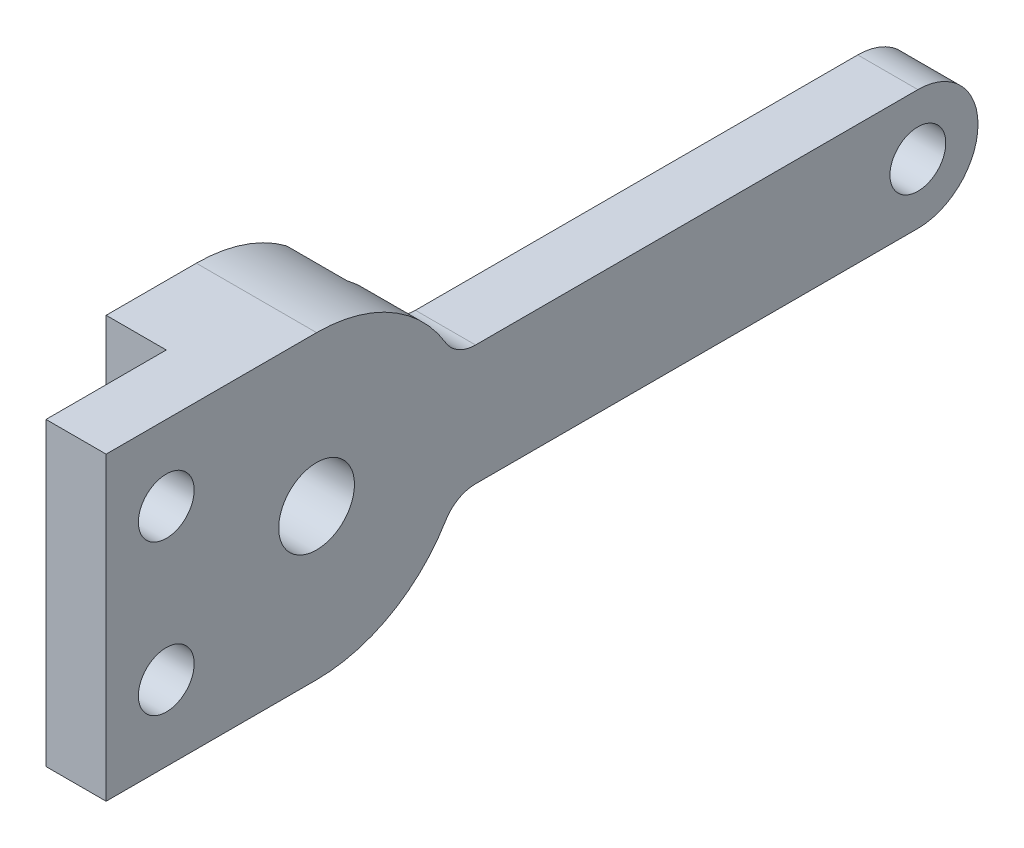
ISO-10303-21;
HEADER;
FILE_DESCRIPTION(('STEP AP214'),'2;1');
FILE_NAME('part.step','',(''),(''),'','','');
FILE_SCHEMA(('AUTOMOTIVE_DESIGN { 1 0 10303 214 1 1 1 1 }'));
ENDSEC;
DATA;
#1=APPLICATION_CONTEXT('core data for automotive mechanical design processes');
#2=APPLICATION_PROTOCOL_DEFINITION('international standard','automotive_design',2000,#1);
#3=PRODUCT_CONTEXT('',#1,'mechanical');
#4=PRODUCT('Part','Part','',(#3));
#5=PRODUCT_RELATED_PRODUCT_CATEGORY('part','',(#4));
#6=PRODUCT_DEFINITION_FORMATION('','',#4);
#7=PRODUCT_DEFINITION_CONTEXT('part definition',#1,'design');
#8=PRODUCT_DEFINITION('design','',#6,#7);
#9=PRODUCT_DEFINITION_SHAPE('','',#8);
#10=(LENGTH_UNIT() NAMED_UNIT(*) SI_UNIT(.MILLI.,.METRE.));
#11=(NAMED_UNIT(*) PLANE_ANGLE_UNIT() SI_UNIT($,.RADIAN.));
#12=(NAMED_UNIT(*) SI_UNIT($,.STERADIAN.) SOLID_ANGLE_UNIT());
#13=UNCERTAINTY_MEASURE_WITH_UNIT(LENGTH_MEASURE(1.E-05),#10,'distance_accuracy_value','');
#14=(GEOMETRIC_REPRESENTATION_CONTEXT(3) GLOBAL_UNCERTAINTY_ASSIGNED_CONTEXT((#13)) GLOBAL_UNIT_ASSIGNED_CONTEXT((#10,
#11,#12)) REPRESENTATION_CONTEXT('',''));
#15=CARTESIAN_POINT('',(0.,0.,0.));
#16=DIRECTION('',(0.,0.,1.));
#17=DIRECTION('',(1.,0.,0.));
#18=AXIS2_PLACEMENT_3D('',#15,#16,#17);
#19=CARTESIAN_POINT('',(6.35,0.,0.));
#20=DIRECTION('',(-1.,0.,0.));
#21=DIRECTION('',(0.,0.,1.));
#22=AXIS2_PLACEMENT_3D('',#19,#20,#21);
#23=PLANE('',#22);
#24=CARTESIAN_POINT('',(6.35,0.,-31.75));
#25=DIRECTION('',(-1.,0.,0.));
#26=DIRECTION('',(0.,0.,1.));
#27=AXIS2_PLACEMENT_3D('',#24,#25,#26);
#28=CIRCLE('',#27,1.4732);
#29=CARTESIAN_POINT('',(6.35,0.,-30.2768));
#30=VERTEX_POINT('',#29);
#31=EDGE_CURVE('E280',#30,#30,#28,.T.);
#32=ORIENTED_EDGE('',*,*,#31,.T.);
#33=EDGE_LOOP('',(#32));
#34=FACE_BOUND('',#33,.T.);
#35=CARTESIAN_POINT('',(6.35,3.96875,7.9375));
#36=DIRECTION('',(1.,0.,0.));
#37=DIRECTION('',(0.,0.,-1.));
#38=AXIS2_PLACEMENT_3D('',#35,#36,#37);
#39=CIRCLE('',#38,1.4732);
#40=CARTESIAN_POINT('',(6.35,3.96875,6.4643));
#41=VERTEX_POINT('',#40);
#42=EDGE_CURVE('E277',#41,#41,#39,.T.);
#43=ORIENTED_EDGE('',*,*,#42,.F.);
#44=EDGE_LOOP('',(#43));
#45=FACE_BOUND('',#44,.T.);
#46=DIRECTION('',(0.,-1.,0.));
#47=VECTOR('',#46,1.);
#48=CARTESIAN_POINT('',(6.35,7.9375,11.1125));
#49=LINE('',#48,#47);
#50=CARTESIAN_POINT('',(6.35,7.9375,11.1125));
#51=VERTEX_POINT('',#50);
#52=CARTESIAN_POINT('',(6.35,-7.9375,11.1125));
#53=VERTEX_POINT('',#52);
#54=EDGE_CURVE('E173',#51,#53,#49,.T.);
#55=ORIENTED_EDGE('',*,*,#54,.T.);
#56=DIRECTION('',(0.,0.,-1.));
#57=VECTOR('',#56,1.);
#58=CARTESIAN_POINT('',(6.35,-7.9375,11.1125));
#59=LINE('',#58,#57);
#60=CARTESIAN_POINT('',(6.35,-7.9375,0.));
#61=VERTEX_POINT('',#60);
#62=EDGE_CURVE('E239',#53,#61,#59,.T.);
#63=ORIENTED_EDGE('',*,*,#62,.T.);
#64=CARTESIAN_POINT('',(6.35,0.,0.));
#65=DIRECTION('',(1.,0.,0.));
#66=DIRECTION('',(0.,0.,1.));
#67=AXIS2_PLACEMENT_3D('',#64,#65,#66);
#68=CIRCLE('',#67,7.9375);
#69=CARTESIAN_POINT('',(6.35,-4.07183441558442,-6.81352117058884));
#70=VERTEX_POINT('',#69);
#71=EDGE_CURVE('E236',#61,#70,#68,.T.);
#72=ORIENTED_EDGE('',*,*,#71,.T.);
#73=CARTESIAN_POINT('',(6.35,-5.0165,-8.39425808216545));
#74=DIRECTION('',(-1.,0.,0.));
#75=DIRECTION('',(0.,0.,1.));
#76=AXIS2_PLACEMENT_3D('',#73,#74,#75);
#77=CIRCLE('',#76,1.8415);
#78=CARTESIAN_POINT('',(6.35,-3.175,-8.39425808216545));
#79=VERTEX_POINT('',#78);
#80=EDGE_CURVE('E201',#70,#79,#77,.T.);
#81=ORIENTED_EDGE('',*,*,#80,.T.);
#82=DIRECTION('',(0.,0.,-1.));
#83=VECTOR('',#82,1.);
#84=CARTESIAN_POINT('',(6.35,-3.175,-31.75));
#85=LINE('',#84,#83);
#86=CARTESIAN_POINT('',(6.35,-3.175,-31.75));
#87=VERTEX_POINT('',#86);
#88=EDGE_CURVE('E234',#79,#87,#85,.T.);
#89=ORIENTED_EDGE('',*,*,#88,.T.);
#90=CARTESIAN_POINT('',(6.35,0.,-31.75));
#91=DIRECTION('',(1.,0.,0.));
#92=DIRECTION('',(0.,0.,1.));
#93=AXIS2_PLACEMENT_3D('',#90,#91,#92);
#94=CIRCLE('',#93,3.175);
#95=CARTESIAN_POINT('',(6.35,3.175,-31.75));
#96=VERTEX_POINT('',#95);
#97=EDGE_CURVE('E230',#87,#96,#94,.T.);
#98=ORIENTED_EDGE('',*,*,#97,.T.);
#99=DIRECTION('',(0.,0.,1.));
#100=VECTOR('',#99,1.);
#101=CARTESIAN_POINT('',(6.35,3.175,-31.75));
#102=LINE('',#101,#100);
#103=CARTESIAN_POINT('',(6.35,3.175,-8.39425808216545));
#104=VERTEX_POINT('',#103);
#105=EDGE_CURVE('E225',#96,#104,#102,.T.);
#106=ORIENTED_EDGE('',*,*,#105,.T.);
#107=CARTESIAN_POINT('',(6.35,5.0165,-8.39425808216545));
#108=DIRECTION('',(-1.,0.,0.));
#109=DIRECTION('',(0.,0.,1.));
#110=AXIS2_PLACEMENT_3D('',#107,#108,#109);
#111=CIRCLE('',#110,1.8415);
#112=CARTESIAN_POINT('',(6.35,4.07183441558442,-6.81352117058884));
#113=VERTEX_POINT('',#112);
#114=EDGE_CURVE('E203',#104,#113,#111,.T.);
#115=ORIENTED_EDGE('',*,*,#114,.T.);
#116=CARTESIAN_POINT('',(6.35,0.,0.));
#117=DIRECTION('',(1.,0.,0.));
#118=DIRECTION('',(0.,0.,1.));
#119=AXIS2_PLACEMENT_3D('',#116,#117,#118);
#120=CIRCLE('',#119,7.9375);
#121=CARTESIAN_POINT('',(6.35,7.9375,0.));
#122=VERTEX_POINT('',#121);
#123=EDGE_CURVE('E223',#113,#122,#120,.T.);
#124=ORIENTED_EDGE('',*,*,#123,.T.);
#125=DIRECTION('',(0.,0.,1.));
#126=VECTOR('',#125,1.);
#127=CARTESIAN_POINT('',(6.35,7.9375,11.1125));
#128=LINE('',#127,#126);
#129=EDGE_CURVE('E178',#122,#51,#128,.T.);
#130=ORIENTED_EDGE('',*,*,#129,.T.);
#131=EDGE_LOOP('',(#55,#63,#72,#81,#89,#98,#106,#115,#124,#130));
#132=FACE_BOUND('',#131,.T.);
#133=CARTESIAN_POINT('',(6.35,0.,0.));
#134=DIRECTION('',(1.,0.,0.));
#135=DIRECTION('',(0.,0.,-1.));
#136=AXIS2_PLACEMENT_3D('',#133,#134,#135);
#137=CIRCLE('',#136,2.);
#138=CARTESIAN_POINT('',(6.35,0.,-2.));
#139=VERTEX_POINT('',#138);
#140=EDGE_CURVE('E167',#139,#139,#137,.T.);
#141=ORIENTED_EDGE('',*,*,#140,.F.);
#142=EDGE_LOOP('',(#141));
#143=FACE_BOUND('',#142,.T.);
#144=CARTESIAN_POINT('',(6.35,-3.96875,7.9375));
#145=DIRECTION('',(1.,0.,0.));
#146=DIRECTION('',(0.,0.,-1.));
#147=AXIS2_PLACEMENT_3D('',#144,#145,#146);
#148=CIRCLE('',#147,1.4732);
#149=CARTESIAN_POINT('',(6.35,-3.96875,6.4643));
#150=VERTEX_POINT('',#149);
#151=EDGE_CURVE('E271',#150,#150,#148,.T.);
#152=ORIENTED_EDGE('',*,*,#151,.F.);
#153=EDGE_LOOP('',(#152));
#154=FACE_BOUND('',#153,.T.);
#155=ADVANCED_FACE('F33',(#34,#45,#132,#143,#154),#23,.F.);
#156=CARTESIAN_POINT('',(6.35,-3.175,-31.75));
#157=DIRECTION('',(0.,1.,0.));
#158=DIRECTION('',(0.,0.,1.));
#159=AXIS2_PLACEMENT_3D('',#156,#157,#158);
#160=PLANE('',#159);
#161=DIRECTION('',(0.,0.,1.));
#162=VECTOR('',#161,1.);
#163=CARTESIAN_POINT('',(3.175,-3.175,-31.75));
#164=LINE('',#163,#162);
#165=CARTESIAN_POINT('',(3.175,-3.175,-31.75));
#166=VERTEX_POINT('',#165);
#167=CARTESIAN_POINT('',(3.175,-3.175,-8.39425808216545));
#168=VERTEX_POINT('',#167);
#169=EDGE_CURVE('E264',#166,#168,#164,.T.);
#170=ORIENTED_EDGE('',*,*,#169,.F.);
#171=DIRECTION('',(-1.,0.,0.));
#172=VECTOR('',#171,1.);
#173=CARTESIAN_POINT('',(6.35,-3.175,-31.75));
#174=LINE('',#173,#172);
#175=EDGE_CURVE('E184',#87,#166,#174,.T.);
#176=ORIENTED_EDGE('',*,*,#175,.F.);
#177=ORIENTED_EDGE('',*,*,#88,.F.);
#178=DIRECTION('',(1.,0.,0.));
#179=VECTOR('',#178,1.);
#180=CARTESIAN_POINT('',(0.,-3.175,-8.39425808216545));
#181=LINE('',#180,#179);
#182=EDGE_CURVE('E191',#79,#168,#181,.F.);
#183=ORIENTED_EDGE('',*,*,#182,.T.);
#184=EDGE_LOOP('',(#170,#176,#177,#183));
#185=FACE_BOUND('',#184,.T.);
#186=ADVANCED_FACE('F302',(#185),#160,.F.);
#187=CARTESIAN_POINT('',(6.35,0.,-31.75));
#188=DIRECTION('',(-1.,0.,0.));
#189=DIRECTION('',(0.,0.,1.));
#190=AXIS2_PLACEMENT_3D('',#187,#188,#189);
#191=CYLINDRICAL_SURFACE('',#190,3.175);
#192=CARTESIAN_POINT('',(3.175,0.,-31.75));
#193=DIRECTION('',(-1.,0.,0.));
#194=DIRECTION('',(0.,0.,1.));
#195=AXIS2_PLACEMENT_3D('',#192,#193,#194);
#196=CIRCLE('',#195,3.175);
#197=CARTESIAN_POINT('',(3.175,3.175,-31.75));
#198=VERTEX_POINT('',#197);
#199=EDGE_CURVE('E216',#198,#166,#196,.T.);
#200=ORIENTED_EDGE('',*,*,#199,.F.);
#201=DIRECTION('',(-1.,0.,0.));
#202=VECTOR('',#201,1.);
#203=CARTESIAN_POINT('',(6.35,3.175,-31.75));
#204=LINE('',#203,#202);
#205=EDGE_CURVE('E181',#96,#198,#204,.T.);
#206=ORIENTED_EDGE('',*,*,#205,.F.);
#207=ORIENTED_EDGE('',*,*,#97,.F.);
#208=ORIENTED_EDGE('',*,*,#175,.T.);
#209=EDGE_LOOP('',(#200,#206,#207,#208));
#210=FACE_BOUND('',#209,.T.);
#211=ADVANCED_FACE('F308',(#210),#191,.T.);
#212=CARTESIAN_POINT('',(6.35,3.175,-31.75));
#213=DIRECTION('',(0.,-1.,0.));
#214=DIRECTION('',(0.,0.,-1.));
#215=AXIS2_PLACEMENT_3D('',#212,#213,#214);
#216=PLANE('',#215);
#217=DIRECTION('',(0.,0.,-1.));
#218=VECTOR('',#217,1.);
#219=CARTESIAN_POINT('',(3.175,3.175,-31.75));
#220=LINE('',#219,#218);
#221=CARTESIAN_POINT('',(3.175,3.175,-8.39425808216545));
#222=VERTEX_POINT('',#221);
#223=EDGE_CURVE('E206',#222,#198,#220,.T.);
#224=ORIENTED_EDGE('',*,*,#223,.F.);
#225=DIRECTION('',(1.,0.,0.));
#226=VECTOR('',#225,1.);
#227=CARTESIAN_POINT('',(6.35,3.175,-8.39425808216545));
#228=LINE('',#227,#226);
#229=EDGE_CURVE('E199',#222,#104,#228,.T.);
#230=ORIENTED_EDGE('',*,*,#229,.T.);
#231=ORIENTED_EDGE('',*,*,#105,.F.);
#232=ORIENTED_EDGE('',*,*,#205,.T.);
#233=EDGE_LOOP('',(#224,#230,#231,#232));
#234=FACE_BOUND('',#233,.T.);
#235=ADVANCED_FACE('F212',(#234),#216,.F.);
#236=CARTESIAN_POINT('',(6.35,-5.0165,-8.39425808216545));
#237=DIRECTION('',(-1.,0.,0.));
#238=DIRECTION('',(0.,0.,1.));
#239=AXIS2_PLACEMENT_3D('',#236,#237,#238);
#240=CYLINDRICAL_SURFACE('',#239,1.8415);
#241=CARTESIAN_POINT('',(3.175,-5.0165,-8.39425808216545));
#242=DIRECTION('',(-1.,0.,0.));
#243=DIRECTION('',(0.,0.,1.));
#244=AXIS2_PLACEMENT_3D('',#241,#242,#243);
#245=CIRCLE('',#244,1.8415);
#246=CARTESIAN_POINT('',(3.175,-4.07183441558442,-6.81352117058884));
#247=VERTEX_POINT('',#246);
#248=EDGE_CURVE('E262',#168,#247,#245,.F.);
#249=ORIENTED_EDGE('',*,*,#248,.F.);
#250=ORIENTED_EDGE('',*,*,#182,.F.);
#251=ORIENTED_EDGE('',*,*,#80,.F.);
#252=DIRECTION('',(-1.,0.,0.));
#253=VECTOR('',#252,1.);
#254=CARTESIAN_POINT('',(6.35,-4.07183441558442,-6.81352117058884));
#255=LINE('',#254,#253);
#256=EDGE_CURVE('E194',#247,#70,#255,.F.);
#257=ORIENTED_EDGE('',*,*,#256,.F.);
#258=EDGE_LOOP('',(#249,#250,#251,#257));
#259=FACE_BOUND('',#258,.T.);
#260=ADVANCED_FACE('F327',(#259),#240,.F.);
#261=CARTESIAN_POINT('',(6.35,5.0165,-8.39425808216545));
#262=DIRECTION('',(-1.,0.,0.));
#263=DIRECTION('',(0.,0.,1.));
#264=AXIS2_PLACEMENT_3D('',#261,#262,#263);
#265=CYLINDRICAL_SURFACE('',#264,1.8415);
#266=CARTESIAN_POINT('',(3.175,5.0165,-8.39425808216545));
#267=DIRECTION('',(-1.,0.,0.));
#268=DIRECTION('',(0.,0.,1.));
#269=AXIS2_PLACEMENT_3D('',#266,#267,#268);
#270=CIRCLE('',#269,1.8415);
#271=CARTESIAN_POINT('',(3.175,4.07183441558442,-6.81352117058884));
#272=VERTEX_POINT('',#271);
#273=EDGE_CURVE('E41',#272,#222,#270,.F.);
#274=ORIENTED_EDGE('',*,*,#273,.F.);
#275=DIRECTION('',(-1.,0.,0.));
#276=VECTOR('',#275,1.);
#277=CARTESIAN_POINT('',(6.35,4.07183441558442,-6.81352117058884));
#278=LINE('',#277,#276);
#279=EDGE_CURVE('E196',#113,#272,#278,.T.);
#280=ORIENTED_EDGE('',*,*,#279,.F.);
#281=ORIENTED_EDGE('',*,*,#114,.F.);
#282=ORIENTED_EDGE('',*,*,#229,.F.);
#283=EDGE_LOOP('',(#274,#280,#281,#282));
#284=FACE_BOUND('',#283,.T.);
#285=ADVANCED_FACE('F35',(#284),#265,.F.);
#286=CARTESIAN_POINT('',(0.,0.,0.));
#287=DIRECTION('',(-1.,0.,0.));
#288=DIRECTION('',(0.,0.,1.));
#289=AXIS2_PLACEMENT_3D('',#286,#287,#288);
#290=PLANE('',#289);
#291=DIRECTION('',(0.,1.,0.));
#292=VECTOR('',#291,1.);
#293=CARTESIAN_POINT('',(0.,11.8610593128453,-4.7625));
#294=LINE('',#293,#292);
#295=CARTESIAN_POINT('',(0.,-6.35,-4.7625));
#296=VERTEX_POINT('',#295);
#297=CARTESIAN_POINT('',(0.,6.35,-4.7625));
#298=VERTEX_POINT('',#297);
#299=EDGE_CURVE('E139',#296,#298,#294,.T.);
#300=ORIENTED_EDGE('',*,*,#299,.F.);
#301=CARTESIAN_POINT('',(0.,0.,0.));
#302=DIRECTION('',(1.,0.,0.));
#303=DIRECTION('',(0.,0.,1.));
#304=AXIS2_PLACEMENT_3D('',#301,#302,#303);
#305=CIRCLE('',#304,7.9375);
#306=CARTESIAN_POINT('',(0.,-7.9375,0.));
#307=VERTEX_POINT('',#306);
#308=EDGE_CURVE('E153',#307,#296,#305,.T.);
#309=ORIENTED_EDGE('',*,*,#308,.F.);
#310=DIRECTION('',(0.,0.,-1.));
#311=VECTOR('',#310,1.);
#312=CARTESIAN_POINT('',(0.,-7.9375,11.1125));
#313=LINE('',#312,#311);
#314=CARTESIAN_POINT('',(0.,-7.9375,4.7625));
#315=VERTEX_POINT('',#314);
#316=EDGE_CURVE('E163',#315,#307,#313,.T.);
#317=ORIENTED_EDGE('',*,*,#316,.F.);
#318=DIRECTION('',(0.,-1.,0.));
#319=VECTOR('',#318,1.);
#320=CARTESIAN_POINT('',(0.,7.9375,4.7625));
#321=LINE('',#320,#319);
#322=CARTESIAN_POINT('',(0.,7.9375,4.7625));
#323=VERTEX_POINT('',#322);
#324=EDGE_CURVE('E144',#323,#315,#321,.T.);
#325=ORIENTED_EDGE('',*,*,#324,.F.);
#326=DIRECTION('',(0.,0.,1.));
#327=VECTOR('',#326,1.);
#328=CARTESIAN_POINT('',(0.,7.9375,11.1125));
#329=LINE('',#328,#327);
#330=CARTESIAN_POINT('',(0.,7.9375,0.));
#331=VERTEX_POINT('',#330);
#332=EDGE_CURVE('E165',#331,#323,#329,.T.);
#333=ORIENTED_EDGE('',*,*,#332,.F.);
#334=CARTESIAN_POINT('',(0.,0.,0.));
#335=DIRECTION('',(1.,0.,0.));
#336=DIRECTION('',(0.,0.,1.));
#337=AXIS2_PLACEMENT_3D('',#334,#335,#336);
#338=CIRCLE('',#337,7.9375);
#339=EDGE_CURVE('E155',#298,#331,#338,.T.);
#340=ORIENTED_EDGE('',*,*,#339,.F.);
#341=EDGE_LOOP('',(#300,#309,#317,#325,#333,#340));
#342=FACE_BOUND('',#341,.T.);
#343=CARTESIAN_POINT('',(0.,0.,0.));
#344=DIRECTION('',(1.,0.,0.));
#345=DIRECTION('',(0.,0.,-1.));
#346=AXIS2_PLACEMENT_3D('',#343,#344,#345);
#347=CIRCLE('',#346,2.);
#348=CARTESIAN_POINT('',(0.,0.,-2.));
#349=VERTEX_POINT('',#348);
#350=EDGE_CURVE('E242',#349,#349,#347,.T.);
#351=ORIENTED_EDGE('',*,*,#350,.T.);
#352=EDGE_LOOP('',(#351));
#353=FACE_BOUND('',#352,.T.);
#354=ADVANCED_FACE('F150',(#342,#353),#290,.T.);
#355=CARTESIAN_POINT('',(6.35,7.9375,11.1125));
#356=DIRECTION('',(0.,0.,-1.));
#357=DIRECTION('',(-1.,0.,0.));
#358=AXIS2_PLACEMENT_3D('',#355,#356,#357);
#359=PLANE('',#358);
#360=DIRECTION('',(-1.,0.,0.));
#361=VECTOR('',#360,1.);
#362=CARTESIAN_POINT('',(6.35,7.9375,11.1125));
#363=LINE('',#362,#361);
#364=CARTESIAN_POINT('',(3.175,7.9375,11.1125));
#365=VERTEX_POINT('',#364);
#366=EDGE_CURVE('E174',#51,#365,#363,.T.);
#367=ORIENTED_EDGE('',*,*,#366,.T.);
#368=DIRECTION('',(0.,1.,0.));
#369=VECTOR('',#368,1.);
#370=CARTESIAN_POINT('',(3.175,7.9375,11.1125));
#371=LINE('',#370,#369);
#372=CARTESIAN_POINT('',(3.175,-7.9375,11.1125));
#373=VERTEX_POINT('',#372);
#374=EDGE_CURVE('E56',#373,#365,#371,.T.);
#375=ORIENTED_EDGE('',*,*,#374,.F.);
#376=DIRECTION('',(-1.,0.,0.));
#377=VECTOR('',#376,1.);
#378=CARTESIAN_POINT('',(6.35,-7.9375,11.1125));
#379=LINE('',#378,#377);
#380=EDGE_CURVE('E188',#53,#373,#379,.T.);
#381=ORIENTED_EDGE('',*,*,#380,.F.);
#382=ORIENTED_EDGE('',*,*,#54,.F.);
#383=EDGE_LOOP('',(#367,#375,#381,#382));
#384=FACE_BOUND('',#383,.T.);
#385=ADVANCED_FACE('F318',(#384),#359,.F.);
#386=CARTESIAN_POINT('',(6.35,-7.9375,11.1125));
#387=DIRECTION('',(0.,1.,0.));
#388=DIRECTION('',(0.,0.,1.));
#389=AXIS2_PLACEMENT_3D('',#386,#387,#388);
#390=PLANE('',#389);
#391=DIRECTION('',(0.,0.,1.));
#392=VECTOR('',#391,1.);
#393=CARTESIAN_POINT('',(3.175,-7.9375,11.1125));
#394=LINE('',#393,#392);
#395=CARTESIAN_POINT('',(3.175,-7.9375,4.7625));
#396=VERTEX_POINT('',#395);
#397=EDGE_CURVE('E250',#396,#373,#394,.T.);
#398=ORIENTED_EDGE('',*,*,#397,.F.);
#399=DIRECTION('',(-1.,0.,0.));
#400=VECTOR('',#399,1.);
#401=CARTESIAN_POINT('',(3.175,-7.9375,4.7625));
#402=LINE('',#401,#400);
#403=EDGE_CURVE('E245',#396,#315,#402,.T.);
#404=ORIENTED_EDGE('',*,*,#403,.T.);
#405=ORIENTED_EDGE('',*,*,#316,.T.);
#406=DIRECTION('',(-1.,0.,0.));
#407=VECTOR('',#406,1.);
#408=CARTESIAN_POINT('',(6.35,-7.9375,0.));
#409=LINE('',#408,#407);
#410=EDGE_CURVE('E162',#61,#307,#409,.T.);
#411=ORIENTED_EDGE('',*,*,#410,.F.);
#412=ORIENTED_EDGE('',*,*,#62,.F.);
#413=ORIENTED_EDGE('',*,*,#380,.T.);
#414=EDGE_LOOP('',(#398,#404,#405,#411,#412,#413));
#415=FACE_BOUND('',#414,.T.);
#416=ADVANCED_FACE('F333',(#415),#390,.F.);
#417=CARTESIAN_POINT('',(6.35,0.,0.));
#418=DIRECTION('',(-1.,0.,0.));
#419=DIRECTION('',(0.,0.,1.));
#420=AXIS2_PLACEMENT_3D('',#417,#418,#419);
#421=CYLINDRICAL_SURFACE('',#420,7.9375);
#422=ORIENTED_EDGE('',*,*,#308,.T.);
#423=DIRECTION('',(-1.,0.,0.));
#424=VECTOR('',#423,1.);
#425=CARTESIAN_POINT('',(6.35,-6.35,-4.7625));
#426=LINE('',#425,#424);
#427=CARTESIAN_POINT('',(3.175,-6.35,-4.7625));
#428=VERTEX_POINT('',#427);
#429=EDGE_CURVE('E136',#296,#428,#426,.F.);
#430=ORIENTED_EDGE('',*,*,#429,.T.);
#431=CARTESIAN_POINT('',(3.175,0.,0.));
#432=DIRECTION('',(-1.,0.,0.));
#433=DIRECTION('',(0.,0.,1.));
#434=AXIS2_PLACEMENT_3D('',#431,#432,#433);
#435=CIRCLE('',#434,7.9375);
#436=EDGE_CURVE('E145',#247,#428,#435,.T.);
#437=ORIENTED_EDGE('',*,*,#436,.F.);
#438=ORIENTED_EDGE('',*,*,#256,.T.);
#439=ORIENTED_EDGE('',*,*,#71,.F.);
#440=ORIENTED_EDGE('',*,*,#410,.T.);
#441=EDGE_LOOP('',(#422,#430,#437,#438,#439,#440));
#442=FACE_BOUND('',#441,.T.);
#443=ADVANCED_FACE('F159',(#442),#421,.T.);
#444=CARTESIAN_POINT('',(6.35,0.,0.));
#445=DIRECTION('',(-1.,0.,0.));
#446=DIRECTION('',(0.,0.,1.));
#447=AXIS2_PLACEMENT_3D('',#444,#445,#446);
#448=CYLINDRICAL_SURFACE('',#447,7.9375);
#449=CARTESIAN_POINT('',(3.175,0.,0.));
#450=DIRECTION('',(-1.,0.,0.));
#451=DIRECTION('',(0.,0.,1.));
#452=AXIS2_PLACEMENT_3D('',#449,#450,#451);
#453=CIRCLE('',#452,7.9375);
#454=CARTESIAN_POINT('',(3.175,6.35,-4.7625));
#455=VERTEX_POINT('',#454);
#456=EDGE_CURVE('E48',#455,#272,#453,.T.);
#457=ORIENTED_EDGE('',*,*,#456,.F.);
#458=DIRECTION('',(-1.,0.,0.));
#459=VECTOR('',#458,1.);
#460=CARTESIAN_POINT('',(6.35,6.35,-4.7625));
#461=LINE('',#460,#459);
#462=EDGE_CURVE('E11',#455,#298,#461,.T.);
#463=ORIENTED_EDGE('',*,*,#462,.T.);
#464=ORIENTED_EDGE('',*,*,#339,.T.);
#465=DIRECTION('',(-1.,0.,0.));
#466=VECTOR('',#465,1.);
#467=CARTESIAN_POINT('',(6.35,7.9375,0.));
#468=LINE('',#467,#466);
#469=EDGE_CURVE('E177',#122,#331,#468,.T.);
#470=ORIENTED_EDGE('',*,*,#469,.F.);
#471=ORIENTED_EDGE('',*,*,#123,.F.);
#472=ORIENTED_EDGE('',*,*,#279,.T.);
#473=EDGE_LOOP('',(#457,#463,#464,#470,#471,#472));
#474=FACE_BOUND('',#473,.T.);
#475=ADVANCED_FACE('F227',(#474),#448,.T.);
#476=CARTESIAN_POINT('',(6.35,7.9375,11.1125));
#477=DIRECTION('',(0.,-1.,0.));
#478=DIRECTION('',(0.,0.,-1.));
#479=AXIS2_PLACEMENT_3D('',#476,#477,#478);
#480=PLANE('',#479);
#481=ORIENTED_EDGE('',*,*,#332,.T.);
#482=DIRECTION('',(-1.,0.,0.));
#483=VECTOR('',#482,1.);
#484=CARTESIAN_POINT('',(3.175,7.9375,4.7625));
#485=LINE('',#484,#483);
#486=CARTESIAN_POINT('',(3.175,7.9375,4.7625));
#487=VERTEX_POINT('',#486);
#488=EDGE_CURVE('E248',#487,#323,#485,.T.);
#489=ORIENTED_EDGE('',*,*,#488,.F.);
#490=DIRECTION('',(0.,0.,-1.));
#491=VECTOR('',#490,1.);
#492=CARTESIAN_POINT('',(3.175,7.9375,11.1125));
#493=LINE('',#492,#491);
#494=EDGE_CURVE('E258',#365,#487,#493,.T.);
#495=ORIENTED_EDGE('',*,*,#494,.F.);
#496=ORIENTED_EDGE('',*,*,#366,.F.);
#497=ORIENTED_EDGE('',*,*,#129,.F.);
#498=ORIENTED_EDGE('',*,*,#469,.T.);
#499=EDGE_LOOP('',(#481,#489,#495,#496,#497,#498));
#500=FACE_BOUND('',#499,.T.);
#501=ADVANCED_FACE('F319',(#500),#480,.F.);
#502=CARTESIAN_POINT('',(6.35,0.,0.));
#503=DIRECTION('',(-1.,0.,0.));
#504=DIRECTION('',(0.,0.,1.));
#505=AXIS2_PLACEMENT_3D('',#502,#503,#504);
#506=CYLINDRICAL_SURFACE('',#505,2.);
#507=ORIENTED_EDGE('',*,*,#140,.T.);
#508=EDGE_LOOP('',(#507));
#509=FACE_BOUND('',#508,.T.);
#510=ORIENTED_EDGE('',*,*,#350,.F.);
#511=EDGE_LOOP('',(#510));
#512=FACE_BOUND('',#511,.T.);
#513=ADVANCED_FACE('F314',(#509,#512),#506,.F.);
#514=CARTESIAN_POINT('',(3.175,7.9375,4.7625));
#515=DIRECTION('',(0.,0.,-1.));
#516=DIRECTION('',(0.,1.,0.));
#517=AXIS2_PLACEMENT_3D('',#514,#515,#516);
#518=PLANE('',#517);
#519=ORIENTED_EDGE('',*,*,#324,.T.);
#520=ORIENTED_EDGE('',*,*,#403,.F.);
#521=DIRECTION('',(0.,-1.,0.));
#522=VECTOR('',#521,1.);
#523=CARTESIAN_POINT('',(3.175,7.9375,4.7625));
#524=LINE('',#523,#522);
#525=EDGE_CURVE('E255',#487,#396,#524,.T.);
#526=ORIENTED_EDGE('',*,*,#525,.F.);
#527=ORIENTED_EDGE('',*,*,#488,.T.);
#528=EDGE_LOOP('',(#519,#520,#526,#527));
#529=FACE_BOUND('',#528,.T.);
#530=ADVANCED_FACE('F356',(#529),#518,.F.);
#531=CARTESIAN_POINT('',(3.175,0.,0.));
#532=DIRECTION('',(1.,0.,0.));
#533=DIRECTION('',(0.,0.,-1.));
#534=AXIS2_PLACEMENT_3D('',#531,#532,#533);
#535=PLANE('',#534);
#536=CARTESIAN_POINT('',(3.175,3.96875,7.9375));
#537=DIRECTION('',(1.,0.,0.));
#538=DIRECTION('',(0.,0.,-1.));
#539=AXIS2_PLACEMENT_3D('',#536,#537,#538);
#540=CIRCLE('',#539,1.4732);
#541=CARTESIAN_POINT('',(3.175,3.96875,6.4643));
#542=VERTEX_POINT('',#541);
#543=EDGE_CURVE('E274',#542,#542,#540,.T.);
#544=ORIENTED_EDGE('',*,*,#543,.T.);
#545=EDGE_LOOP('',(#544));
#546=FACE_BOUND('',#545,.T.);
#547=CARTESIAN_POINT('',(3.175,-3.96875,7.9375));
#548=DIRECTION('',(1.,0.,0.));
#549=DIRECTION('',(0.,0.,-1.));
#550=AXIS2_PLACEMENT_3D('',#547,#548,#549);
#551=CIRCLE('',#550,1.4732);
#552=CARTESIAN_POINT('',(3.175,-3.96875,6.4643));
#553=VERTEX_POINT('',#552);
#554=EDGE_CURVE('E156',#553,#553,#551,.T.);
#555=ORIENTED_EDGE('',*,*,#554,.T.);
#556=EDGE_LOOP('',(#555));
#557=FACE_BOUND('',#556,.T.);
#558=ORIENTED_EDGE('',*,*,#374,.T.);
#559=ORIENTED_EDGE('',*,*,#494,.T.);
#560=ORIENTED_EDGE('',*,*,#525,.T.);
#561=ORIENTED_EDGE('',*,*,#397,.T.);
#562=EDGE_LOOP('',(#558,#559,#560,#561));
#563=FACE_BOUND('',#562,.T.);
#564=ADVANCED_FACE('F299',(#546,#557,#563),#535,.F.);
#565=CARTESIAN_POINT('',(3.175,11.8610593128453,-4.7625));
#566=DIRECTION('',(0.,0.,1.));
#567=DIRECTION('',(0.,-1.,0.));
#568=AXIS2_PLACEMENT_3D('',#565,#566,#567);
#569=PLANE('',#568);
#570=ORIENTED_EDGE('',*,*,#299,.T.);
#571=ORIENTED_EDGE('',*,*,#462,.F.);
#572=DIRECTION('',(0.,1.,0.));
#573=VECTOR('',#572,1.);
#574=CARTESIAN_POINT('',(3.175,11.8610593128453,-4.7625));
#575=LINE('',#574,#573);
#576=EDGE_CURVE('E140',#428,#455,#575,.T.);
#577=ORIENTED_EDGE('',*,*,#576,.F.);
#578=ORIENTED_EDGE('',*,*,#429,.F.);
#579=EDGE_LOOP('',(#570,#571,#577,#578));
#580=FACE_BOUND('',#579,.T.);
#581=ADVANCED_FACE('F138',(#580),#569,.F.);
#582=CARTESIAN_POINT('',(3.175,0.,0.));
#583=DIRECTION('',(-1.,0.,0.));
#584=DIRECTION('',(0.,0.,1.));
#585=AXIS2_PLACEMENT_3D('',#582,#583,#584);
#586=PLANE('',#585);
#587=CARTESIAN_POINT('',(3.175,0.,-31.75));
#588=DIRECTION('',(-1.,0.,0.));
#589=DIRECTION('',(0.,0.,1.));
#590=AXIS2_PLACEMENT_3D('',#587,#588,#589);
#591=CIRCLE('',#590,1.4732);
#592=CARTESIAN_POINT('',(3.175,0.,-30.2768));
#593=VERTEX_POINT('',#592);
#594=EDGE_CURVE('E283',#593,#593,#591,.T.);
#595=ORIENTED_EDGE('',*,*,#594,.F.);
#596=EDGE_LOOP('',(#595));
#597=FACE_BOUND('',#596,.T.);
#598=ORIENTED_EDGE('',*,*,#436,.T.);
#599=ORIENTED_EDGE('',*,*,#576,.T.);
#600=ORIENTED_EDGE('',*,*,#456,.T.);
#601=ORIENTED_EDGE('',*,*,#273,.T.);
#602=ORIENTED_EDGE('',*,*,#223,.T.);
#603=ORIENTED_EDGE('',*,*,#199,.T.);
#604=ORIENTED_EDGE('',*,*,#169,.T.);
#605=ORIENTED_EDGE('',*,*,#248,.T.);
#606=EDGE_LOOP('',(#598,#599,#600,#601,#602,#603,#604,#605));
#607=FACE_BOUND('',#606,.T.);
#608=ADVANCED_FACE('F205',(#597,#607),#586,.T.);
#609=CARTESIAN_POINT('',(6.35,-3.96875,7.9375));
#610=DIRECTION('',(1.,0.,0.));
#611=DIRECTION('',(0.,0.,-1.));
#612=AXIS2_PLACEMENT_3D('',#609,#610,#611);
#613=CYLINDRICAL_SURFACE('',#612,1.4732);
#614=ORIENTED_EDGE('',*,*,#151,.T.);
#615=EDGE_LOOP('',(#614));
#616=FACE_BOUND('',#615,.T.);
#617=ORIENTED_EDGE('',*,*,#554,.F.);
#618=EDGE_LOOP('',(#617));
#619=FACE_BOUND('',#618,.T.);
#620=ADVANCED_FACE('F290',(#616,#619),#613,.F.);
#621=CARTESIAN_POINT('',(6.35,3.96875,7.9375));
#622=DIRECTION('',(1.,0.,0.));
#623=DIRECTION('',(0.,0.,-1.));
#624=AXIS2_PLACEMENT_3D('',#621,#622,#623);
#625=CYLINDRICAL_SURFACE('',#624,1.4732);
#626=ORIENTED_EDGE('',*,*,#42,.T.);
#627=EDGE_LOOP('',(#626));
#628=FACE_BOUND('',#627,.T.);
#629=ORIENTED_EDGE('',*,*,#543,.F.);
#630=EDGE_LOOP('',(#629));
#631=FACE_BOUND('',#630,.T.);
#632=ADVANCED_FACE('F296',(#628,#631),#625,.F.);
#633=CARTESIAN_POINT('',(3.175,0.,-31.75));
#634=DIRECTION('',(-1.,0.,0.));
#635=DIRECTION('',(0.,0.,1.));
#636=AXIS2_PLACEMENT_3D('',#633,#634,#635);
#637=CYLINDRICAL_SURFACE('',#636,1.4732);
#638=ORIENTED_EDGE('',*,*,#31,.F.);
#639=EDGE_LOOP('',(#638));
#640=FACE_BOUND('',#639,.T.);
#641=ORIENTED_EDGE('',*,*,#594,.T.);
#642=EDGE_LOOP('',(#641));
#643=FACE_BOUND('',#642,.T.);
#644=ADVANCED_FACE('F287',(#640,#643),#637,.F.);
#645=CLOSED_SHELL('',(#155,#186,#211,#235,#260,#285,#354,#385,#416,#443,#475,#501,#513,#530,
#564,#581,#608,#620,#632,#644));
#646=MANIFOLD_SOLID_BREP('B2',#645);
#647=ADVANCED_BREP_SHAPE_REPRESENTATION('',(#18,#646),#14);
#648=SHAPE_DEFINITION_REPRESENTATION(#9,#647);
ENDSEC;
END-ISO-10303-21;
